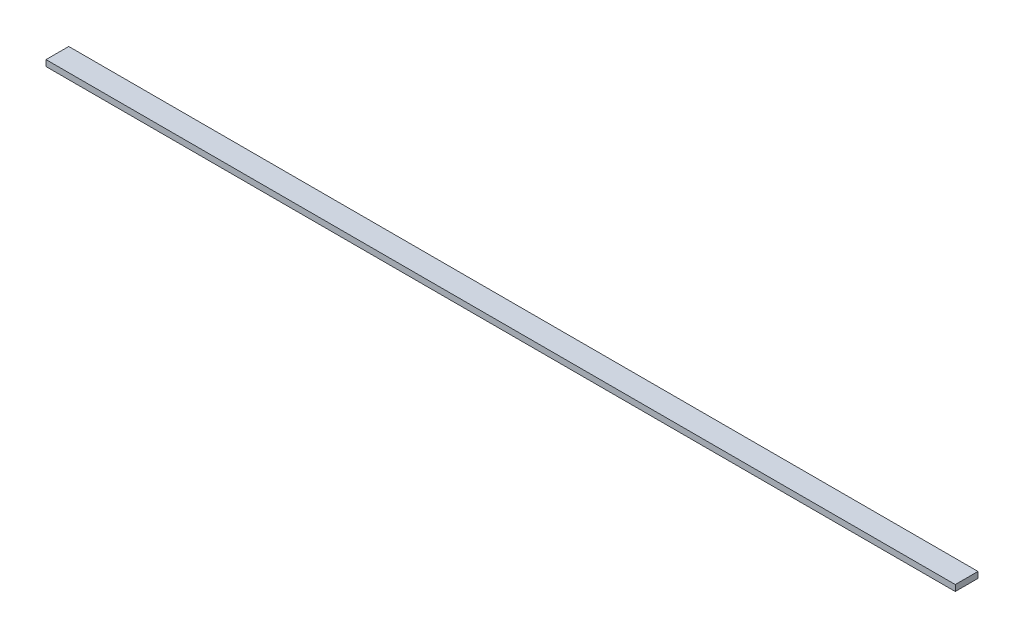
ISO-10303-21;
HEADER;
FILE_DESCRIPTION(('STEP AP214'),'2;1');
FILE_NAME('part.step','',(''),(''),'','','');
FILE_SCHEMA(('AUTOMOTIVE_DESIGN { 1 0 10303 214 1 1 1 1 }'));
ENDSEC;
DATA;
#1=APPLICATION_CONTEXT('core data for automotive mechanical design processes');
#2=APPLICATION_PROTOCOL_DEFINITION('international standard','automotive_design',2000,#1);
#3=PRODUCT_CONTEXT('',#1,'mechanical');
#4=PRODUCT('Part','Part','',(#3));
#5=PRODUCT_RELATED_PRODUCT_CATEGORY('part','',(#4));
#6=PRODUCT_DEFINITION_FORMATION('','',#4);
#7=PRODUCT_DEFINITION_CONTEXT('part definition',#1,'design');
#8=PRODUCT_DEFINITION('design','',#6,#7);
#9=PRODUCT_DEFINITION_SHAPE('','',#8);
#10=(LENGTH_UNIT() NAMED_UNIT(*) SI_UNIT(.MILLI.,.METRE.));
#11=(NAMED_UNIT(*) PLANE_ANGLE_UNIT() SI_UNIT($,.RADIAN.));
#12=(NAMED_UNIT(*) SI_UNIT($,.STERADIAN.) SOLID_ANGLE_UNIT());
#13=UNCERTAINTY_MEASURE_WITH_UNIT(LENGTH_MEASURE(1.E-05),#10,'distance_accuracy_value','');
#14=(GEOMETRIC_REPRESENTATION_CONTEXT(3) GLOBAL_UNCERTAINTY_ASSIGNED_CONTEXT((#13)) GLOBAL_UNIT_ASSIGNED_CONTEXT((#10,
#11,#12)) REPRESENTATION_CONTEXT('',''));
#15=CARTESIAN_POINT('',(0.,0.,0.));
#16=DIRECTION('',(0.,0.,1.));
#17=DIRECTION('',(1.,0.,0.));
#18=AXIS2_PLACEMENT_3D('',#15,#16,#17);
#19=CARTESIAN_POINT('',(600.,8.,-15.));
#20=DIRECTION('',(-1.,0.,0.));
#21=DIRECTION('',(0.,0.,1.));
#22=AXIS2_PLACEMENT_3D('',#19,#20,#21);
#23=PLANE('',#22);
#24=DIRECTION('',(0.,0.,-1.));
#25=VECTOR('',#24,1.);
#26=CARTESIAN_POINT('',(600.,0.,-15.));
#27=LINE('',#26,#25);
#28=CARTESIAN_POINT('',(600.,0.,15.));
#29=VERTEX_POINT('',#28);
#30=CARTESIAN_POINT('',(600.,0.,-15.));
#31=VERTEX_POINT('',#30);
#32=EDGE_CURVE('E100',#29,#31,#27,.T.);
#33=ORIENTED_EDGE('',*,*,#32,.T.);
#34=DIRECTION('',(0.,-1.,0.));
#35=VECTOR('',#34,1.);
#36=CARTESIAN_POINT('',(600.,8.,-15.));
#37=LINE('',#36,#35);
#38=CARTESIAN_POINT('',(600.,8.,-15.));
#39=VERTEX_POINT('',#38);
#40=EDGE_CURVE('E11',#39,#31,#37,.T.);
#41=ORIENTED_EDGE('',*,*,#40,.F.);
#42=DIRECTION('',(0.,0.,-1.));
#43=VECTOR('',#42,1.);
#44=CARTESIAN_POINT('',(600.,8.,-15.));
#45=LINE('',#44,#43);
#46=CARTESIAN_POINT('',(600.,8.,15.));
#47=VERTEX_POINT('',#46);
#48=EDGE_CURVE('E88',#47,#39,#45,.T.);
#49=ORIENTED_EDGE('',*,*,#48,.F.);
#50=DIRECTION('',(0.,-1.,0.));
#51=VECTOR('',#50,1.);
#52=CARTESIAN_POINT('',(600.,8.,15.));
#53=LINE('',#52,#51);
#54=EDGE_CURVE('E96',#47,#29,#53,.T.);
#55=ORIENTED_EDGE('',*,*,#54,.T.);
#56=EDGE_LOOP('',(#33,#41,#49,#55));
#57=FACE_BOUND('',#56,.T.);
#58=ADVANCED_FACE('F37',(#57),#23,.F.);
#59=CARTESIAN_POINT('',(-600.,8.,-15.));
#60=DIRECTION('',(0.,0.,1.));
#61=DIRECTION('',(1.,0.,0.));
#62=AXIS2_PLACEMENT_3D('',#59,#60,#61);
#63=PLANE('',#62);
#64=DIRECTION('',(-1.,0.,0.));
#65=VECTOR('',#64,1.);
#66=CARTESIAN_POINT('',(-600.,0.,-15.));
#67=LINE('',#66,#65);
#68=CARTESIAN_POINT('',(-600.,0.,-15.));
#69=VERTEX_POINT('',#68);
#70=EDGE_CURVE('E92',#31,#69,#67,.T.);
#71=ORIENTED_EDGE('',*,*,#70,.T.);
#72=DIRECTION('',(0.,-1.,0.));
#73=VECTOR('',#72,1.);
#74=CARTESIAN_POINT('',(-600.,8.,-15.));
#75=LINE('',#74,#73);
#76=CARTESIAN_POINT('',(-600.,8.,-15.));
#77=VERTEX_POINT('',#76);
#78=EDGE_CURVE('E45',#77,#69,#75,.T.);
#79=ORIENTED_EDGE('',*,*,#78,.F.);
#80=DIRECTION('',(-1.,0.,0.));
#81=VECTOR('',#80,1.);
#82=CARTESIAN_POINT('',(-600.,8.,-15.));
#83=LINE('',#82,#81);
#84=EDGE_CURVE('E83',#39,#77,#83,.T.);
#85=ORIENTED_EDGE('',*,*,#84,.F.);
#86=ORIENTED_EDGE('',*,*,#40,.T.);
#87=EDGE_LOOP('',(#71,#79,#85,#86));
#88=FACE_BOUND('',#87,.T.);
#89=ADVANCED_FACE('F91',(#88),#63,.F.);
#90=CARTESIAN_POINT('',(-600.,8.,-15.));
#91=DIRECTION('',(1.,0.,0.));
#92=DIRECTION('',(0.,0.,-1.));
#93=AXIS2_PLACEMENT_3D('',#90,#91,#92);
#94=PLANE('',#93);
#95=DIRECTION('',(0.,0.,1.));
#96=VECTOR('',#95,1.);
#97=CARTESIAN_POINT('',(-600.,0.,-15.));
#98=LINE('',#97,#96);
#99=CARTESIAN_POINT('',(-600.,0.,15.));
#100=VERTEX_POINT('',#99);
#101=EDGE_CURVE('E70',#69,#100,#98,.T.);
#102=ORIENTED_EDGE('',*,*,#101,.T.);
#103=DIRECTION('',(0.,-1.,0.));
#104=VECTOR('',#103,1.);
#105=CARTESIAN_POINT('',(-600.,8.,15.));
#106=LINE('',#105,#104);
#107=CARTESIAN_POINT('',(-600.,8.,15.));
#108=VERTEX_POINT('',#107);
#109=EDGE_CURVE('E93',#108,#100,#106,.T.);
#110=ORIENTED_EDGE('',*,*,#109,.F.);
#111=DIRECTION('',(0.,0.,1.));
#112=VECTOR('',#111,1.);
#113=CARTESIAN_POINT('',(-600.,8.,-15.));
#114=LINE('',#113,#112);
#115=EDGE_CURVE('E86',#77,#108,#114,.T.);
#116=ORIENTED_EDGE('',*,*,#115,.F.);
#117=ORIENTED_EDGE('',*,*,#78,.T.);
#118=EDGE_LOOP('',(#102,#110,#116,#117));
#119=FACE_BOUND('',#118,.T.);
#120=ADVANCED_FACE('F94',(#119),#94,.F.);
#121=CARTESIAN_POINT('',(-600.,8.,15.));
#122=DIRECTION('',(0.,0.,-1.));
#123=DIRECTION('',(-1.,0.,0.));
#124=AXIS2_PLACEMENT_3D('',#121,#122,#123);
#125=PLANE('',#124);
#126=DIRECTION('',(1.,0.,0.));
#127=VECTOR('',#126,1.);
#128=CARTESIAN_POINT('',(-600.,0.,15.));
#129=LINE('',#128,#127);
#130=EDGE_CURVE('E76',#100,#29,#129,.T.);
#131=ORIENTED_EDGE('',*,*,#130,.T.);
#132=ORIENTED_EDGE('',*,*,#54,.F.);
#133=DIRECTION('',(1.,0.,0.));
#134=VECTOR('',#133,1.);
#135=CARTESIAN_POINT('',(-600.,8.,15.));
#136=LINE('',#135,#134);
#137=EDGE_CURVE('E53',#108,#47,#136,.T.);
#138=ORIENTED_EDGE('',*,*,#137,.F.);
#139=ORIENTED_EDGE('',*,*,#109,.T.);
#140=EDGE_LOOP('',(#131,#132,#138,#139));
#141=FACE_BOUND('',#140,.T.);
#142=ADVANCED_FACE('F107',(#141),#125,.F.);
#143=CARTESIAN_POINT('',(0.,8.,0.));
#144=DIRECTION('',(0.,1.,0.));
#145=DIRECTION('',(0.,0.,1.));
#146=AXIS2_PLACEMENT_3D('',#143,#144,#145);
#147=PLANE('',#146);
#148=ORIENTED_EDGE('',*,*,#48,.T.);
#149=ORIENTED_EDGE('',*,*,#84,.T.);
#150=ORIENTED_EDGE('',*,*,#115,.T.);
#151=ORIENTED_EDGE('',*,*,#137,.T.);
#152=EDGE_LOOP('',(#148,#149,#150,#151));
#153=FACE_BOUND('',#152,.T.);
#154=ADVANCED_FACE('F84',(#153),#147,.T.);
#155=CARTESIAN_POINT('',(0.,0.,0.));
#156=DIRECTION('',(0.,1.,0.));
#157=DIRECTION('',(0.,0.,1.));
#158=AXIS2_PLACEMENT_3D('',#155,#156,#157);
#159=PLANE('',#158);
#160=ORIENTED_EDGE('',*,*,#32,.F.);
#161=ORIENTED_EDGE('',*,*,#130,.F.);
#162=ORIENTED_EDGE('',*,*,#101,.F.);
#163=ORIENTED_EDGE('',*,*,#70,.F.);
#164=EDGE_LOOP('',(#160,#161,#162,#163));
#165=FACE_BOUND('',#164,.T.);
#166=ADVANCED_FACE('F110',(#165),#159,.F.);
#167=CLOSED_SHELL('',(#58,#89,#120,#142,#154,#166));
#168=MANIFOLD_SOLID_BREP('B2',#167);
#169=ADVANCED_BREP_SHAPE_REPRESENTATION('',(#18,#168),#14);
#170=SHAPE_DEFINITION_REPRESENTATION(#9,#169);
ENDSEC;
END-ISO-10303-21;
